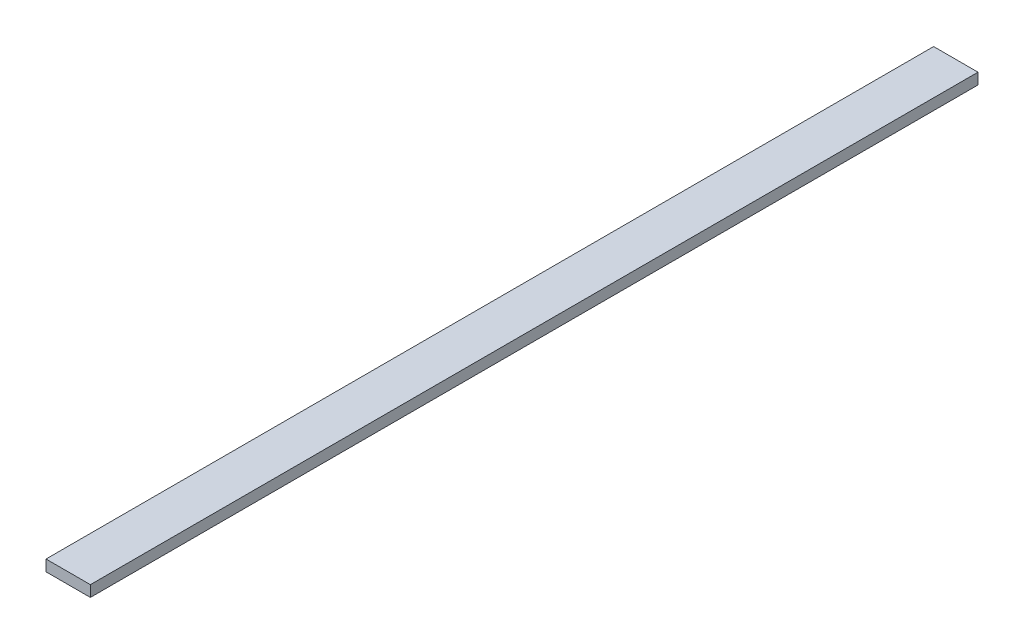
ISO-10303-21;
HEADER;
FILE_DESCRIPTION(('STEP AP214'),'2;1');
FILE_NAME('part.step','',(''),(''),'','','');
FILE_SCHEMA(('AUTOMOTIVE_DESIGN { 1 0 10303 214 1 1 1 1 }'));
ENDSEC;
DATA;
#1=APPLICATION_CONTEXT('core data for automotive mechanical design processes');
#2=APPLICATION_PROTOCOL_DEFINITION('international standard','automotive_design',2000,#1);
#3=PRODUCT_CONTEXT('',#1,'mechanical');
#4=PRODUCT('Part','Part','',(#3));
#5=PRODUCT_RELATED_PRODUCT_CATEGORY('part','',(#4));
#6=PRODUCT_DEFINITION_FORMATION('','',#4);
#7=PRODUCT_DEFINITION_CONTEXT('part definition',#1,'design');
#8=PRODUCT_DEFINITION('design','',#6,#7);
#9=PRODUCT_DEFINITION_SHAPE('','',#8);
#10=(LENGTH_UNIT() NAMED_UNIT(*) SI_UNIT(.MILLI.,.METRE.));
#11=(NAMED_UNIT(*) PLANE_ANGLE_UNIT() SI_UNIT($,.RADIAN.));
#12=(NAMED_UNIT(*) SI_UNIT($,.STERADIAN.) SOLID_ANGLE_UNIT());
#13=UNCERTAINTY_MEASURE_WITH_UNIT(LENGTH_MEASURE(1.E-05),#10,'distance_accuracy_value','');
#14=(GEOMETRIC_REPRESENTATION_CONTEXT(3) GLOBAL_UNCERTAINTY_ASSIGNED_CONTEXT((#13)) GLOBAL_UNIT_ASSIGNED_CONTEXT((#10,
#11,#12)) REPRESENTATION_CONTEXT('',''));
#15=CARTESIAN_POINT('',(0.,0.,0.));
#16=DIRECTION('',(0.,0.,1.));
#17=DIRECTION('',(1.,0.,0.));
#18=AXIS2_PLACEMENT_3D('',#15,#16,#17);
#19=CARTESIAN_POINT('',(-21.7938129689016,125.,-9954.836917703));
#20=DIRECTION('',(1.,0.,0.));
#21=DIRECTION('',(0.,0.,-1.));
#22=AXIS2_PLACEMENT_3D('',#19,#20,#21);
#23=PLANE('',#22);
#24=DIRECTION('',(0.,0.,1.));
#25=VECTOR('',#24,1.);
#26=CARTESIAN_POINT('',(-21.7938129689016,0.,-9954.836917703));
#27=LINE('',#26,#25);
#28=CARTESIAN_POINT('',(-21.7938129689016,0.,-9954.836917703));
#29=VERTEX_POINT('',#28);
#30=CARTESIAN_POINT('',(-21.7938129689004,0.,45.1630822969984));
#31=VERTEX_POINT('',#30);
#32=EDGE_CURVE('E99',#29,#31,#27,.T.);
#33=ORIENTED_EDGE('',*,*,#32,.T.);
#34=DIRECTION('',(0.,-1.,0.));
#35=VECTOR('',#34,1.);
#36=CARTESIAN_POINT('',(-21.7938129689004,125.,45.1630822969984));
#37=LINE('',#36,#35);
#38=CARTESIAN_POINT('',(-21.7938129689004,125.,45.1630822969984));
#39=VERTEX_POINT('',#38);
#40=EDGE_CURVE('E11',#39,#31,#37,.T.);
#41=ORIENTED_EDGE('',*,*,#40,.F.);
#42=DIRECTION('',(0.,0.,1.));
#43=VECTOR('',#42,1.);
#44=CARTESIAN_POINT('',(-21.7938129689016,125.,-9954.836917703));
#45=LINE('',#44,#43);
#46=CARTESIAN_POINT('',(-21.7938129689016,125.,-9954.836917703));
#47=VERTEX_POINT('',#46);
#48=EDGE_CURVE('E87',#47,#39,#45,.T.);
#49=ORIENTED_EDGE('',*,*,#48,.F.);
#50=DIRECTION('',(0.,-1.,0.));
#51=VECTOR('',#50,1.);
#52=CARTESIAN_POINT('',(-21.7938129689016,125.,-9954.836917703));
#53=LINE('',#52,#51);
#54=EDGE_CURVE('E95',#47,#29,#53,.T.);
#55=ORIENTED_EDGE('',*,*,#54,.T.);
#56=EDGE_LOOP('',(#33,#41,#49,#55));
#57=FACE_BOUND('',#56,.T.);
#58=ADVANCED_FACE('F36',(#57),#23,.F.);
#59=CARTESIAN_POINT('',(-21.7938129689004,125.,45.1630822969984));
#60=DIRECTION('',(0.,0.,-1.));
#61=DIRECTION('',(-1.,0.,0.));
#62=AXIS2_PLACEMENT_3D('',#59,#60,#61);
#63=PLANE('',#62);
#64=DIRECTION('',(1.,0.,0.));
#65=VECTOR('',#64,1.);
#66=CARTESIAN_POINT('',(-21.7938129689004,0.,45.1630822969984));
#67=LINE('',#66,#65);
#68=CARTESIAN_POINT('',(478.2061870311,0.,45.1630822969984));
#69=VERTEX_POINT('',#68);
#70=EDGE_CURVE('E91',#31,#69,#67,.T.);
#71=ORIENTED_EDGE('',*,*,#70,.T.);
#72=DIRECTION('',(0.,-1.,0.));
#73=VECTOR('',#72,1.);
#74=CARTESIAN_POINT('',(478.2061870311,125.,45.1630822969984));
#75=LINE('',#74,#73);
#76=CARTESIAN_POINT('',(478.2061870311,125.,45.1630822969984));
#77=VERTEX_POINT('',#76);
#78=EDGE_CURVE('E44',#77,#69,#75,.T.);
#79=ORIENTED_EDGE('',*,*,#78,.F.);
#80=DIRECTION('',(1.,0.,0.));
#81=VECTOR('',#80,1.);
#82=CARTESIAN_POINT('',(-21.7938129689004,125.,45.1630822969984));
#83=LINE('',#82,#81);
#84=EDGE_CURVE('E82',#39,#77,#83,.T.);
#85=ORIENTED_EDGE('',*,*,#84,.F.);
#86=ORIENTED_EDGE('',*,*,#40,.T.);
#87=EDGE_LOOP('',(#71,#79,#85,#86));
#88=FACE_BOUND('',#87,.T.);
#89=ADVANCED_FACE('F90',(#88),#63,.F.);
#90=CARTESIAN_POINT('',(478.206187031098,125.,-9954.836917703));
#91=DIRECTION('',(-1.,0.,0.));
#92=DIRECTION('',(0.,0.,1.));
#93=AXIS2_PLACEMENT_3D('',#90,#91,#92);
#94=PLANE('',#93);
#95=DIRECTION('',(0.,0.,-1.));
#96=VECTOR('',#95,1.);
#97=CARTESIAN_POINT('',(478.206187031098,0.,-9954.836917703));
#98=LINE('',#97,#96);
#99=CARTESIAN_POINT('',(478.206187031098,0.,-9954.836917703));
#100=VERTEX_POINT('',#99);
#101=EDGE_CURVE('E69',#69,#100,#98,.T.);
#102=ORIENTED_EDGE('',*,*,#101,.T.);
#103=DIRECTION('',(0.,-1.,0.));
#104=VECTOR('',#103,1.);
#105=CARTESIAN_POINT('',(478.206187031098,125.,-9954.836917703));
#106=LINE('',#105,#104);
#107=CARTESIAN_POINT('',(478.206187031098,125.,-9954.836917703));
#108=VERTEX_POINT('',#107);
#109=EDGE_CURVE('E92',#108,#100,#106,.T.);
#110=ORIENTED_EDGE('',*,*,#109,.F.);
#111=DIRECTION('',(0.,0.,-1.));
#112=VECTOR('',#111,1.);
#113=CARTESIAN_POINT('',(478.206187031098,125.,-9954.836917703));
#114=LINE('',#113,#112);
#115=EDGE_CURVE('E85',#77,#108,#114,.T.);
#116=ORIENTED_EDGE('',*,*,#115,.F.);
#117=ORIENTED_EDGE('',*,*,#78,.T.);
#118=EDGE_LOOP('',(#102,#110,#116,#117));
#119=FACE_BOUND('',#118,.T.);
#120=ADVANCED_FACE('F93',(#119),#94,.F.);
#121=CARTESIAN_POINT('',(-21.7938129689016,125.,-9954.836917703));
#122=DIRECTION('',(0.,0.,1.));
#123=DIRECTION('',(1.,0.,0.));
#124=AXIS2_PLACEMENT_3D('',#121,#122,#123);
#125=PLANE('',#124);
#126=DIRECTION('',(-1.,0.,0.));
#127=VECTOR('',#126,1.);
#128=CARTESIAN_POINT('',(-21.7938129689016,0.,-9954.836917703));
#129=LINE('',#128,#127);
#130=EDGE_CURVE('E75',#100,#29,#129,.T.);
#131=ORIENTED_EDGE('',*,*,#130,.T.);
#132=ORIENTED_EDGE('',*,*,#54,.F.);
#133=DIRECTION('',(-1.,0.,0.));
#134=VECTOR('',#133,1.);
#135=CARTESIAN_POINT('',(-21.7938129689016,125.,-9954.836917703));
#136=LINE('',#135,#134);
#137=EDGE_CURVE('E52',#108,#47,#136,.T.);
#138=ORIENTED_EDGE('',*,*,#137,.F.);
#139=ORIENTED_EDGE('',*,*,#109,.T.);
#140=EDGE_LOOP('',(#131,#132,#138,#139));
#141=FACE_BOUND('',#140,.T.);
#142=ADVANCED_FACE('F106',(#141),#125,.F.);
#143=CARTESIAN_POINT('',(0.,125.,0.));
#144=DIRECTION('',(0.,1.,0.));
#145=DIRECTION('',(0.,0.,1.));
#146=AXIS2_PLACEMENT_3D('',#143,#144,#145);
#147=PLANE('',#146);
#148=ORIENTED_EDGE('',*,*,#48,.T.);
#149=ORIENTED_EDGE('',*,*,#84,.T.);
#150=ORIENTED_EDGE('',*,*,#115,.T.);
#151=ORIENTED_EDGE('',*,*,#137,.T.);
#152=EDGE_LOOP('',(#148,#149,#150,#151));
#153=FACE_BOUND('',#152,.T.);
#154=ADVANCED_FACE('F83',(#153),#147,.T.);
#155=CARTESIAN_POINT('',(0.,0.,0.));
#156=DIRECTION('',(0.,1.,0.));
#157=DIRECTION('',(0.,0.,1.));
#158=AXIS2_PLACEMENT_3D('',#155,#156,#157);
#159=PLANE('',#158);
#160=ORIENTED_EDGE('',*,*,#32,.F.);
#161=ORIENTED_EDGE('',*,*,#130,.F.);
#162=ORIENTED_EDGE('',*,*,#101,.F.);
#163=ORIENTED_EDGE('',*,*,#70,.F.);
#164=EDGE_LOOP('',(#160,#161,#162,#163));
#165=FACE_BOUND('',#164,.T.);
#166=ADVANCED_FACE('F109',(#165),#159,.F.);
#167=CLOSED_SHELL('',(#58,#89,#120,#142,#154,#166));
#168=MANIFOLD_SOLID_BREP('B2',#167);
#169=ADVANCED_BREP_SHAPE_REPRESENTATION('',(#18,#168),#14);
#170=SHAPE_DEFINITION_REPRESENTATION(#9,#169);
ENDSEC;
END-ISO-10303-21;
